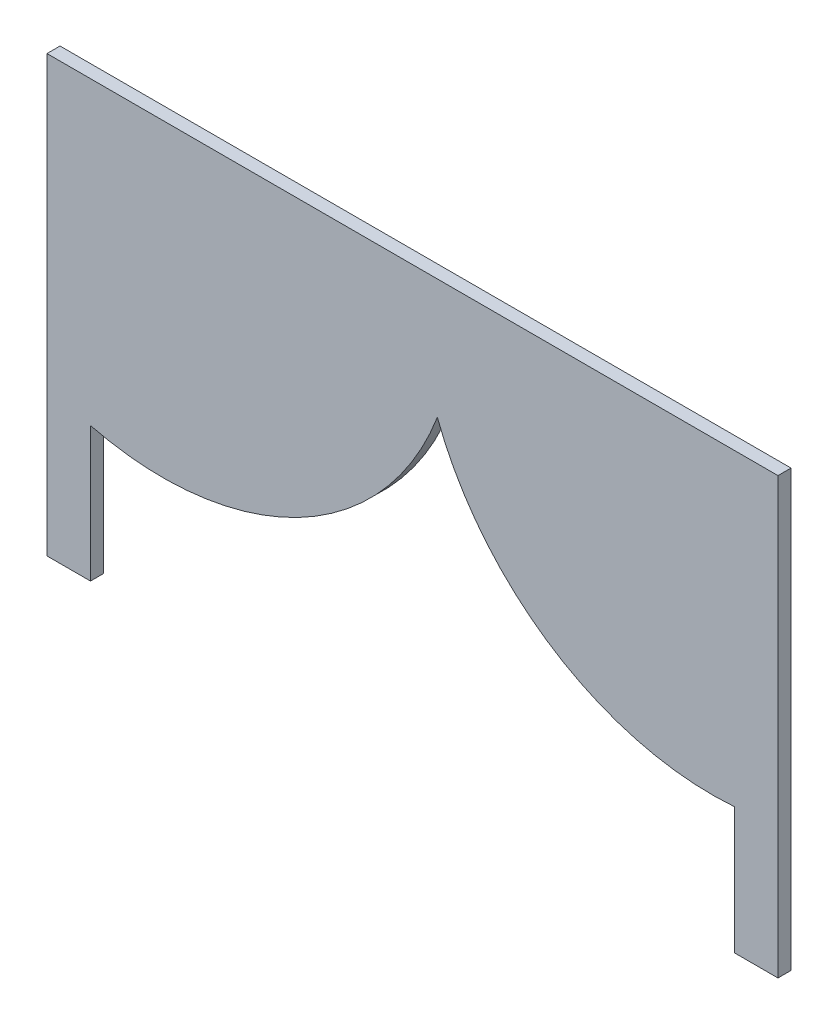
ISO-10303-21;
HEADER;
FILE_DESCRIPTION(('STEP AP214'),'2;1');
FILE_NAME('part.step','',(''),(''),'','','');
FILE_SCHEMA(('AUTOMOTIVE_DESIGN { 1 0 10303 214 1 1 1 1 }'));
ENDSEC;
DATA;
#1=APPLICATION_CONTEXT('core data for automotive mechanical design processes');
#2=APPLICATION_PROTOCOL_DEFINITION('international standard','automotive_design',2000,#1);
#3=PRODUCT_CONTEXT('',#1,'mechanical');
#4=PRODUCT('Part','Part','',(#3));
#5=PRODUCT_RELATED_PRODUCT_CATEGORY('part','',(#4));
#6=PRODUCT_DEFINITION_FORMATION('','',#4);
#7=PRODUCT_DEFINITION_CONTEXT('part definition',#1,'design');
#8=PRODUCT_DEFINITION('design','',#6,#7);
#9=PRODUCT_DEFINITION_SHAPE('','',#8);
#10=(LENGTH_UNIT() NAMED_UNIT(*) SI_UNIT(.MILLI.,.METRE.));
#11=(NAMED_UNIT(*) PLANE_ANGLE_UNIT() SI_UNIT($,.RADIAN.));
#12=(NAMED_UNIT(*) SI_UNIT($,.STERADIAN.) SOLID_ANGLE_UNIT());
#13=UNCERTAINTY_MEASURE_WITH_UNIT(LENGTH_MEASURE(1.E-05),#10,'distance_accuracy_value','');
#14=(GEOMETRIC_REPRESENTATION_CONTEXT(3) GLOBAL_UNCERTAINTY_ASSIGNED_CONTEXT((#13)) GLOBAL_UNIT_ASSIGNED_CONTEXT((#10,
#11,#12)) REPRESENTATION_CONTEXT('',''));
#15=CARTESIAN_POINT('',(0.,0.,0.));
#16=DIRECTION('',(0.,0.,1.));
#17=DIRECTION('',(1.,0.,0.));
#18=AXIS2_PLACEMENT_3D('',#15,#16,#17);
#19=CARTESIAN_POINT('',(-79.7127717694608,-53.4004593865838,3.));
#20=DIRECTION('',(0.,1.,0.));
#21=DIRECTION('',(0.,0.,1.));
#22=AXIS2_PLACEMENT_3D('',#19,#20,#21);
#23=PLANE('',#22);
#24=DIRECTION('',(1.,0.,0.));
#25=VECTOR('',#24,1.);
#26=CARTESIAN_POINT('',(-79.7127717694608,-53.4004593865838,0.));
#27=LINE('',#26,#25);
#28=CARTESIAN_POINT('',(-89.7127717694608,-53.4004593865838,0.));
#29=VERTEX_POINT('',#28);
#30=CARTESIAN_POINT('',(-79.7127717694608,-53.4004593865838,0.));
#31=VERTEX_POINT('',#30);
#32=EDGE_CURVE('E150',#29,#31,#27,.T.);
#33=ORIENTED_EDGE('',*,*,#32,.T.);
#34=DIRECTION('',(0.,0.,-1.));
#35=VECTOR('',#34,1.);
#36=CARTESIAN_POINT('',(-79.7127717694608,-53.4004593865838,3.));
#37=LINE('',#36,#35);
#38=CARTESIAN_POINT('',(-79.7127717694608,-53.4004593865838,3.));
#39=VERTEX_POINT('',#38);
#40=EDGE_CURVE('E11',#39,#31,#37,.T.);
#41=ORIENTED_EDGE('',*,*,#40,.F.);
#42=DIRECTION('',(1.,0.,0.));
#43=VECTOR('',#42,1.);
#44=CARTESIAN_POINT('',(-79.7127717694608,-53.4004593865838,3.));
#45=LINE('',#44,#43);
#46=CARTESIAN_POINT('',(-89.7127717694608,-53.4004593865838,3.));
#47=VERTEX_POINT('',#46);
#48=EDGE_CURVE('E176',#47,#39,#45,.T.);
#49=ORIENTED_EDGE('',*,*,#48,.F.);
#50=DIRECTION('',(0.,0.,-1.));
#51=VECTOR('',#50,1.);
#52=CARTESIAN_POINT('',(-89.7127717694608,-53.4004593865838,3.));
#53=LINE('',#52,#51);
#54=EDGE_CURVE('E146',#47,#29,#53,.T.);
#55=ORIENTED_EDGE('',*,*,#54,.T.);
#56=EDGE_LOOP('',(#33,#41,#49,#55));
#57=FACE_BOUND('',#56,.T.);
#58=ADVANCED_FACE('F43',(#57),#23,.F.);
#59=CARTESIAN_POINT('',(-79.7127717694608,-22.4459407209817,3.));
#60=DIRECTION('',(-1.,0.,0.));
#61=DIRECTION('',(0.,0.,1.));
#62=AXIS2_PLACEMENT_3D('',#59,#60,#61);
#63=PLANE('',#62);
#64=DIRECTION('',(0.,1.,0.));
#65=VECTOR('',#64,1.);
#66=CARTESIAN_POINT('',(-79.7127717694608,-22.4459407209817,0.));
#67=LINE('',#66,#65);
#68=CARTESIAN_POINT('',(-79.7127717694608,-22.4459407209817,0.));
#69=VERTEX_POINT('',#68);
#70=EDGE_CURVE('E154',#31,#69,#67,.T.);
#71=ORIENTED_EDGE('',*,*,#70,.T.);
#72=DIRECTION('',(0.,0.,-1.));
#73=VECTOR('',#72,1.);
#74=CARTESIAN_POINT('',(-79.7127717694608,-22.4459407209817,3.));
#75=LINE('',#74,#73);
#76=CARTESIAN_POINT('',(-79.7127717694608,-22.4459407209817,3.));
#77=VERTEX_POINT('',#76);
#78=EDGE_CURVE('E52',#77,#69,#75,.T.);
#79=ORIENTED_EDGE('',*,*,#78,.F.);
#80=DIRECTION('',(0.,1.,0.));
#81=VECTOR('',#80,1.);
#82=CARTESIAN_POINT('',(-79.7127717694608,-43.4004593865838,3.));
#83=LINE('',#82,#81);
#84=EDGE_CURVE('E106',#39,#77,#83,.T.);
#85=ORIENTED_EDGE('',*,*,#84,.F.);
#86=ORIENTED_EDGE('',*,*,#40,.T.);
#87=EDGE_LOOP('',(#71,#79,#85,#86));
#88=FACE_BOUND('',#87,.T.);
#89=ADVANCED_FACE('F231',(#88),#63,.F.);
#90=CARTESIAN_POINT('',(-63.1692210459789,43.0883235898246,3.));
#91=DIRECTION('',(0.,0.,-1.));
#92=DIRECTION('',(-1.,0.,0.));
#93=AXIS2_PLACEMENT_3D('',#90,#91,#92);
#94=CYLINDRICAL_SURFACE('',#93,67.5901536416293);
#95=CARTESIAN_POINT('',(-63.1692210459789,43.0883235898246,0.));
#96=DIRECTION('',(0.,0.,1.));
#97=DIRECTION('',(1.,0.,0.));
#98=AXIS2_PLACEMENT_3D('',#95,#96,#97);
#99=CIRCLE('',#98,67.5901536416293);
#100=CARTESIAN_POINT('',(0.,19.0450629593837,0.));
#101=VERTEX_POINT('',#100);
#102=EDGE_CURVE('E157',#69,#101,#99,.T.);
#103=ORIENTED_EDGE('',*,*,#102,.T.);
#104=DIRECTION('',(0.,0.,-1.));
#105=VECTOR('',#104,1.);
#106=CARTESIAN_POINT('',(0.,19.0450629593837,3.));
#107=LINE('',#106,#105);
#108=CARTESIAN_POINT('',(0.,19.0450629593837,3.));
#109=VERTEX_POINT('',#108);
#110=EDGE_CURVE('E191',#109,#101,#107,.T.);
#111=ORIENTED_EDGE('',*,*,#110,.F.);
#112=CARTESIAN_POINT('',(-63.1692210459789,43.0883235898246,3.));
#113=DIRECTION('',(0.,0.,1.));
#114=DIRECTION('',(1.,0.,0.));
#115=AXIS2_PLACEMENT_3D('',#112,#113,#114);
#116=CIRCLE('',#115,67.5901536416293);
#117=EDGE_CURVE('E201',#77,#109,#116,.T.);
#118=ORIENTED_EDGE('',*,*,#117,.F.);
#119=ORIENTED_EDGE('',*,*,#78,.T.);
#120=EDGE_LOOP('',(#103,#111,#118,#119));
#121=FACE_BOUND('',#120,.T.);
#122=ADVANCED_FACE('F199',(#121),#94,.T.);
#123=CARTESIAN_POINT('',(63.1692210459789,43.0883235898246,3.));
#124=DIRECTION('',(0.,0.,-1.));
#125=DIRECTION('',(-1.,0.,0.));
#126=AXIS2_PLACEMENT_3D('',#123,#124,#125);
#127=CYLINDRICAL_SURFACE('',#126,67.5901536416293);
#128=CARTESIAN_POINT('',(63.1692210459789,43.0883235898246,0.));
#129=DIRECTION('',(0.,0.,1.));
#130=DIRECTION('',(-1.,0.,0.));
#131=AXIS2_PLACEMENT_3D('',#128,#129,#130);
#132=CIRCLE('',#131,67.5901536416293);
#133=CARTESIAN_POINT('',(68.2872282305393,-24.3077806874839,0.));
#134=VERTEX_POINT('',#133);
#135=EDGE_CURVE('E160',#101,#134,#132,.T.);
#136=ORIENTED_EDGE('',*,*,#135,.T.);
#137=DIRECTION('',(0.,0.,-1.));
#138=VECTOR('',#137,1.);
#139=CARTESIAN_POINT('',(68.2872282305393,-24.3077806874839,3.));
#140=LINE('',#139,#138);
#141=CARTESIAN_POINT('',(68.2872282305393,-24.3077806874839,3.));
#142=VERTEX_POINT('',#141);
#143=EDGE_CURVE('E187',#142,#134,#140,.T.);
#144=ORIENTED_EDGE('',*,*,#143,.F.);
#145=CARTESIAN_POINT('',(63.1692210459789,43.0883235898246,3.));
#146=DIRECTION('',(0.,0.,1.));
#147=DIRECTION('',(-1.,0.,0.));
#148=AXIS2_PLACEMENT_3D('',#145,#146,#147);
#149=CIRCLE('',#148,67.5901536416293);
#150=EDGE_CURVE('E217',#109,#142,#149,.T.);
#151=ORIENTED_EDGE('',*,*,#150,.F.);
#152=ORIENTED_EDGE('',*,*,#110,.T.);
#153=EDGE_LOOP('',(#136,#144,#151,#152));
#154=FACE_BOUND('',#153,.T.);
#155=ADVANCED_FACE('F209',(#154),#127,.T.);
#156=CARTESIAN_POINT('',(68.2872282305393,-43.4004593865838,3.));
#157=DIRECTION('',(1.,0.,0.));
#158=DIRECTION('',(0.,1.,0.));
#159=AXIS2_PLACEMENT_3D('',#156,#157,#158);
#160=PLANE('',#159);
#161=DIRECTION('',(0.,-1.,0.));
#162=VECTOR('',#161,1.);
#163=CARTESIAN_POINT('',(68.2872282305393,-43.4004593865838,0.));
#164=LINE('',#163,#162);
#165=CARTESIAN_POINT('',(68.2872282305392,-53.4004593865838,0.));
#166=VERTEX_POINT('',#165);
#167=EDGE_CURVE('E164',#134,#166,#164,.T.);
#168=ORIENTED_EDGE('',*,*,#167,.T.);
#169=DIRECTION('',(0.,0.,-1.));
#170=VECTOR('',#169,1.);
#171=CARTESIAN_POINT('',(68.2872282305392,-53.4004593865838,3.));
#172=LINE('',#171,#170);
#173=CARTESIAN_POINT('',(68.2872282305392,-53.4004593865838,3.));
#174=VERTEX_POINT('',#173);
#175=EDGE_CURVE('E183',#174,#166,#172,.T.);
#176=ORIENTED_EDGE('',*,*,#175,.F.);
#177=DIRECTION('',(0.,-1.,0.));
#178=VECTOR('',#177,1.);
#179=CARTESIAN_POINT('',(68.2872282305393,-24.3077806874839,3.));
#180=LINE('',#179,#178);
#181=EDGE_CURVE('E215',#142,#174,#180,.T.);
#182=ORIENTED_EDGE('',*,*,#181,.F.);
#183=ORIENTED_EDGE('',*,*,#143,.T.);
#184=EDGE_LOOP('',(#168,#176,#182,#183));
#185=FACE_BOUND('',#184,.T.);
#186=ADVANCED_FACE('F213',(#185),#160,.F.);
#187=CARTESIAN_POINT('',(78.2872282305392,-53.4004593865838,3.));
#188=DIRECTION('',(0.,1.,0.));
#189=DIRECTION('',(0.,0.,1.));
#190=AXIS2_PLACEMENT_3D('',#187,#188,#189);
#191=PLANE('',#190);
#192=DIRECTION('',(1.,0.,0.));
#193=VECTOR('',#192,1.);
#194=CARTESIAN_POINT('',(78.2872282305392,-53.4004593865838,0.));
#195=LINE('',#194,#193);
#196=CARTESIAN_POINT('',(78.2872282305392,-53.4004593865838,0.));
#197=VERTEX_POINT('',#196);
#198=EDGE_CURVE('E167',#166,#197,#195,.T.);
#199=ORIENTED_EDGE('',*,*,#198,.T.);
#200=DIRECTION('',(0.,0.,-1.));
#201=VECTOR('',#200,1.);
#202=CARTESIAN_POINT('',(78.2872282305392,-53.4004593865838,3.));
#203=LINE('',#202,#201);
#204=CARTESIAN_POINT('',(78.2872282305392,-53.4004593865838,3.));
#205=VERTEX_POINT('',#204);
#206=EDGE_CURVE('E139',#205,#197,#203,.T.);
#207=ORIENTED_EDGE('',*,*,#206,.F.);
#208=DIRECTION('',(1.,0.,0.));
#209=VECTOR('',#208,1.);
#210=CARTESIAN_POINT('',(78.2872282305392,-53.4004593865838,3.));
#211=LINE('',#210,#209);
#212=EDGE_CURVE('E128',#174,#205,#211,.T.);
#213=ORIENTED_EDGE('',*,*,#212,.F.);
#214=ORIENTED_EDGE('',*,*,#175,.T.);
#215=EDGE_LOOP('',(#199,#207,#213,#214));
#216=FACE_BOUND('',#215,.T.);
#217=ADVANCED_FACE('F243',(#216),#191,.F.);
#218=CARTESIAN_POINT('',(78.2872282305392,46.5995406134162,3.));
#219=DIRECTION('',(-1.,0.,0.));
#220=DIRECTION('',(0.,-1.,0.));
#221=AXIS2_PLACEMENT_3D('',#218,#219,#220);
#222=PLANE('',#221);
#223=DIRECTION('',(0.,1.,0.));
#224=VECTOR('',#223,1.);
#225=CARTESIAN_POINT('',(78.2872282305392,46.5995406134162,0.));
#226=LINE('',#225,#224);
#227=CARTESIAN_POINT('',(78.2872282305392,46.5995406134162,0.));
#228=VERTEX_POINT('',#227);
#229=EDGE_CURVE('E137',#197,#228,#226,.T.);
#230=ORIENTED_EDGE('',*,*,#229,.T.);
#231=DIRECTION('',(0.,0.,-1.));
#232=VECTOR('',#231,1.);
#233=CARTESIAN_POINT('',(78.2872282305392,46.5995406134162,3.));
#234=LINE('',#233,#232);
#235=CARTESIAN_POINT('',(78.2872282305392,46.5995406134162,3.));
#236=VERTEX_POINT('',#235);
#237=EDGE_CURVE('E134',#236,#228,#234,.T.);
#238=ORIENTED_EDGE('',*,*,#237,.F.);
#239=DIRECTION('',(0.,1.,0.));
#240=VECTOR('',#239,1.);
#241=CARTESIAN_POINT('',(78.2872282305392,46.5995406134162,3.));
#242=LINE('',#241,#240);
#243=EDGE_CURVE('E122',#205,#236,#242,.T.);
#244=ORIENTED_EDGE('',*,*,#243,.F.);
#245=ORIENTED_EDGE('',*,*,#206,.T.);
#246=EDGE_LOOP('',(#230,#238,#244,#245));
#247=FACE_BOUND('',#246,.T.);
#248=ADVANCED_FACE('F135',(#247),#222,.F.);
#249=CARTESIAN_POINT('',(78.2872282305392,46.5995406134162,3.));
#250=DIRECTION('',(0.,-1.,0.));
#251=DIRECTION('',(1.,0.,0.));
#252=AXIS2_PLACEMENT_3D('',#249,#250,#251);
#253=PLANE('',#252);
#254=DIRECTION('',(-1.,0.,0.));
#255=VECTOR('',#254,1.);
#256=CARTESIAN_POINT('',(78.2872282305392,46.5995406134162,0.));
#257=LINE('',#256,#255);
#258=CARTESIAN_POINT('',(-89.7127717694608,46.5995406134162,0.));
#259=VERTEX_POINT('',#258);
#260=EDGE_CURVE('E92',#228,#259,#257,.T.);
#261=ORIENTED_EDGE('',*,*,#260,.T.);
#262=DIRECTION('',(0.,0.,-1.));
#263=VECTOR('',#262,1.);
#264=CARTESIAN_POINT('',(-89.7127717694608,46.5995406134162,3.));
#265=LINE('',#264,#263);
#266=CARTESIAN_POINT('',(-89.7127717694608,46.5995406134162,3.));
#267=VERTEX_POINT('',#266);
#268=EDGE_CURVE('E140',#267,#259,#265,.T.);
#269=ORIENTED_EDGE('',*,*,#268,.F.);
#270=DIRECTION('',(-1.,0.,0.));
#271=VECTOR('',#270,1.);
#272=CARTESIAN_POINT('',(78.2872282305392,46.5995406134162,3.));
#273=LINE('',#272,#271);
#274=EDGE_CURVE('E126',#236,#267,#273,.T.);
#275=ORIENTED_EDGE('',*,*,#274,.F.);
#276=ORIENTED_EDGE('',*,*,#237,.T.);
#277=EDGE_LOOP('',(#261,#269,#275,#276));
#278=FACE_BOUND('',#277,.T.);
#279=ADVANCED_FACE('F142',(#278),#253,.F.);
#280=CARTESIAN_POINT('',(-89.7127717694608,46.5995406134162,3.));
#281=DIRECTION('',(1.,0.,0.));
#282=DIRECTION('',(0.,0.,-1.));
#283=AXIS2_PLACEMENT_3D('',#280,#281,#282);
#284=PLANE('',#283);
#285=DIRECTION('',(0.,-1.,0.));
#286=VECTOR('',#285,1.);
#287=CARTESIAN_POINT('',(-89.7127717694608,46.5995406134162,0.));
#288=LINE('',#287,#286);
#289=EDGE_CURVE('E98',#259,#29,#288,.T.);
#290=ORIENTED_EDGE('',*,*,#289,.T.);
#291=ORIENTED_EDGE('',*,*,#54,.F.);
#292=DIRECTION('',(0.,-1.,0.));
#293=VECTOR('',#292,1.);
#294=CARTESIAN_POINT('',(-89.7127717694608,46.5995406134162,3.));
#295=LINE('',#294,#293);
#296=EDGE_CURVE('E60',#267,#47,#295,.T.);
#297=ORIENTED_EDGE('',*,*,#296,.F.);
#298=ORIENTED_EDGE('',*,*,#268,.T.);
#299=EDGE_LOOP('',(#290,#291,#297,#298));
#300=FACE_BOUND('',#299,.T.);
#301=ADVANCED_FACE('F251',(#300),#284,.F.);
#302=CARTESIAN_POINT('',(63.1692210459789,43.0883235898246,3.));
#303=DIRECTION('',(0.,0.,-1.));
#304=DIRECTION('',(-1.,0.,0.));
#305=AXIS2_PLACEMENT_3D('',#302,#303,#304);
#306=PLANE('',#305);
#307=ORIENTED_EDGE('',*,*,#48,.T.);
#308=ORIENTED_EDGE('',*,*,#84,.T.);
#309=ORIENTED_EDGE('',*,*,#117,.T.);
#310=ORIENTED_EDGE('',*,*,#150,.T.);
#311=ORIENTED_EDGE('',*,*,#181,.T.);
#312=ORIENTED_EDGE('',*,*,#212,.T.);
#313=ORIENTED_EDGE('',*,*,#243,.T.);
#314=ORIENTED_EDGE('',*,*,#274,.T.);
#315=ORIENTED_EDGE('',*,*,#296,.T.);
#316=EDGE_LOOP('',(#307,#308,#309,#310,#311,#312,#313,#314,#315));
#317=FACE_BOUND('',#316,.T.);
#318=ADVANCED_FACE('F124',(#317),#306,.F.);
#319=CARTESIAN_POINT('',(63.1692210459789,43.0883235898246,0.));
#320=DIRECTION('',(0.,0.,-1.));
#321=DIRECTION('',(-1.,0.,0.));
#322=AXIS2_PLACEMENT_3D('',#319,#320,#321);
#323=PLANE('',#322);
#324=ORIENTED_EDGE('',*,*,#32,.F.);
#325=ORIENTED_EDGE('',*,*,#289,.F.);
#326=ORIENTED_EDGE('',*,*,#260,.F.);
#327=ORIENTED_EDGE('',*,*,#229,.F.);
#328=ORIENTED_EDGE('',*,*,#198,.F.);
#329=ORIENTED_EDGE('',*,*,#167,.F.);
#330=ORIENTED_EDGE('',*,*,#135,.F.);
#331=ORIENTED_EDGE('',*,*,#102,.F.);
#332=ORIENTED_EDGE('',*,*,#70,.F.);
#333=EDGE_LOOP('',(#324,#325,#326,#327,#328,#329,#330,#331,#332));
#334=FACE_BOUND('',#333,.T.);
#335=ADVANCED_FACE('F205',(#334),#323,.T.);
#336=CLOSED_SHELL('',(#58,#89,#122,#155,#186,#217,#248,#279,#301,#318,#335));
#337=MANIFOLD_SOLID_BREP('B2',#336);
#338=ADVANCED_BREP_SHAPE_REPRESENTATION('',(#18,#337),#14);
#339=SHAPE_DEFINITION_REPRESENTATION(#9,#338);
ENDSEC;
END-ISO-10303-21;
